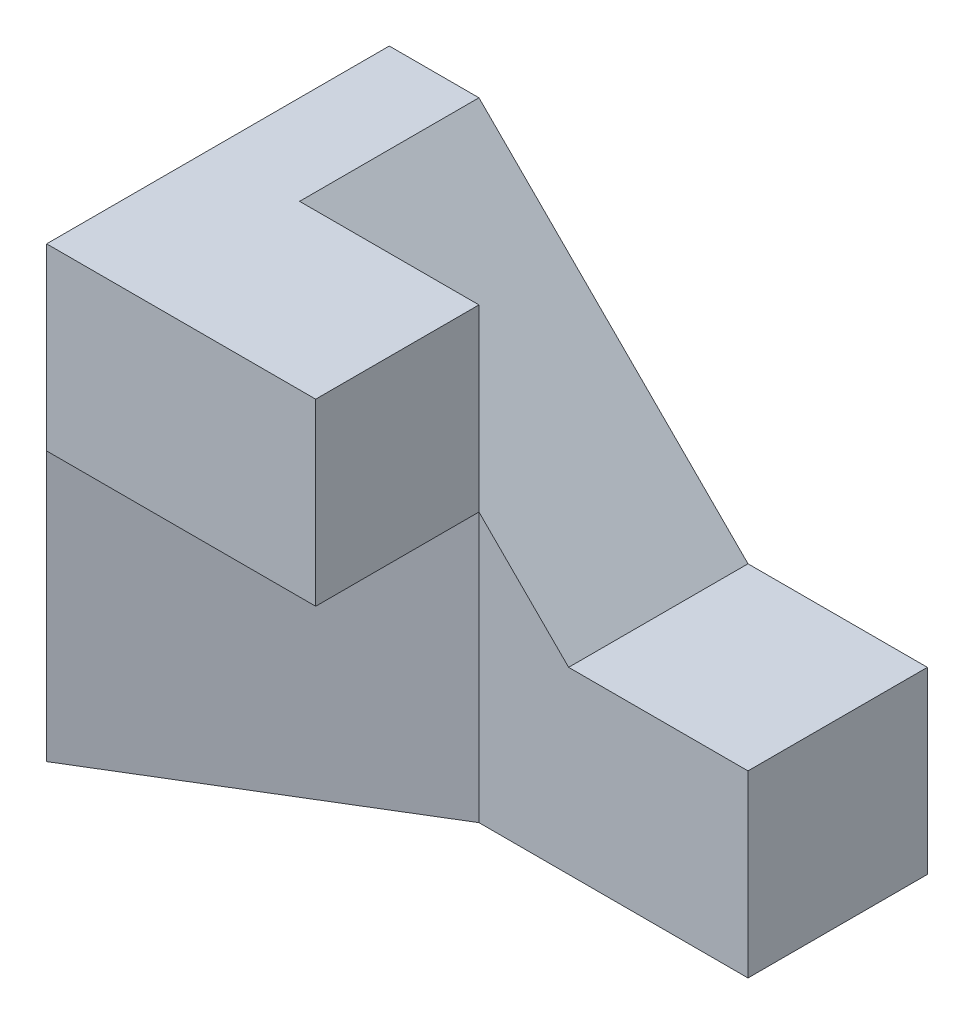
ISO-10303-21;
HEADER;
FILE_DESCRIPTION(('STEP AP214'),'2;1');
FILE_NAME('part.step','',(''),(''),'','','');
FILE_SCHEMA(('AUTOMOTIVE_DESIGN { 1 0 10303 214 1 1 1 1 }'));
ENDSEC;
DATA;
#1=APPLICATION_CONTEXT('core data for automotive mechanical design processes');
#2=APPLICATION_PROTOCOL_DEFINITION('international standard','automotive_design',2000,#1);
#3=PRODUCT_CONTEXT('',#1,'mechanical');
#4=PRODUCT('Part','Part','',(#3));
#5=PRODUCT_RELATED_PRODUCT_CATEGORY('part','',(#4));
#6=PRODUCT_DEFINITION_FORMATION('','',#4);
#7=PRODUCT_DEFINITION_CONTEXT('part definition',#1,'design');
#8=PRODUCT_DEFINITION('design','',#6,#7);
#9=PRODUCT_DEFINITION_SHAPE('','',#8);
#10=(LENGTH_UNIT() NAMED_UNIT(*) SI_UNIT(.MILLI.,.METRE.));
#11=(NAMED_UNIT(*) PLANE_ANGLE_UNIT() SI_UNIT($,.RADIAN.));
#12=(NAMED_UNIT(*) SI_UNIT($,.STERADIAN.) SOLID_ANGLE_UNIT());
#13=UNCERTAINTY_MEASURE_WITH_UNIT(LENGTH_MEASURE(1.E-05),#10,'distance_accuracy_value','');
#14=(GEOMETRIC_REPRESENTATION_CONTEXT(3) GLOBAL_UNCERTAINTY_ASSIGNED_CONTEXT((#13)) GLOBAL_UNIT_ASSIGNED_CONTEXT((#10,
#11,#12)) REPRESENTATION_CONTEXT('',''));
#15=CARTESIAN_POINT('',(0.,0.,0.));
#16=DIRECTION('',(0.,0.,1.));
#17=DIRECTION('',(1.,0.,0.));
#18=AXIS2_PLACEMENT_3D('',#15,#16,#17);
#19=CARTESIAN_POINT('',(0.,5.,-2.));
#20=DIRECTION('',(-1.,0.,0.));
#21=DIRECTION('',(0.,0.,1.));
#22=AXIS2_PLACEMENT_3D('',#19,#20,#21);
#23=PLANE('',#22);
#24=DIRECTION('',(0.,1.,0.));
#25=VECTOR('',#24,1.);
#26=CARTESIAN_POINT('',(0.,5.,1.82062342999278));
#27=LINE('',#26,#25);
#28=CARTESIAN_POINT('',(0.,3.,1.82062342999279));
#29=VERTEX_POINT('',#28);
#30=CARTESIAN_POINT('',(0.,5.,1.82062342999278));
#31=VERTEX_POINT('',#30);
#32=EDGE_CURVE('E227',#29,#31,#27,.T.);
#33=ORIENTED_EDGE('',*,*,#32,.T.);
#34=DIRECTION('',(0.,0.,1.));
#35=VECTOR('',#34,1.);
#36=CARTESIAN_POINT('',(0.,5.,-2.));
#37=LINE('',#36,#35);
#38=CARTESIAN_POINT('',(0.,5.,-2.));
#39=VERTEX_POINT('',#38);
#40=EDGE_CURVE('E11',#39,#31,#37,.T.);
#41=ORIENTED_EDGE('',*,*,#40,.F.);
#42=DIRECTION('',(0.,-1.,0.));
#43=VECTOR('',#42,1.);
#44=CARTESIAN_POINT('',(0.,5.,-2.));
#45=LINE('',#44,#43);
#46=CARTESIAN_POINT('',(0.,0.,-2.));
#47=VERTEX_POINT('',#46);
#48=EDGE_CURVE('E153',#39,#47,#45,.T.);
#49=ORIENTED_EDGE('',*,*,#48,.T.);
#50=DIRECTION('',(0.,0.,1.));
#51=VECTOR('',#50,1.);
#52=CARTESIAN_POINT('',(0.,0.,-2.));
#53=LINE('',#52,#51);
#54=CARTESIAN_POINT('',(0.,0.,1.82062342999278));
#55=VERTEX_POINT('',#54);
#56=EDGE_CURVE('E84',#47,#55,#53,.T.);
#57=ORIENTED_EDGE('',*,*,#56,.T.);
#58=DIRECTION('',(0.,1.,0.));
#59=VECTOR('',#58,1.);
#60=CARTESIAN_POINT('',(0.,0.,1.82062342999278));
#61=LINE('',#60,#59);
#62=EDGE_CURVE('E132',#55,#29,#61,.T.);
#63=ORIENTED_EDGE('',*,*,#62,.T.);
#64=EDGE_LOOP('',(#33,#41,#49,#57,#63));
#65=FACE_BOUND('',#64,.T.);
#66=ADVANCED_FACE('F33',(#65),#23,.T.);
#67=CARTESIAN_POINT('',(1.,5.,-2.));
#68=DIRECTION('',(0.,1.,0.));
#69=DIRECTION('',(0.,0.,1.));
#70=AXIS2_PLACEMENT_3D('',#67,#68,#69);
#71=PLANE('',#70);
#72=ORIENTED_EDGE('',*,*,#40,.T.);
#73=DIRECTION('',(-1.,0.,0.));
#74=VECTOR('',#73,1.);
#75=CARTESIAN_POINT('',(3.,5.,1.82062342999278));
#76=LINE('',#75,#74);
#77=CARTESIAN_POINT('',(3.,5.,1.82062342999278));
#78=VERTEX_POINT('',#77);
#79=EDGE_CURVE('E147',#78,#31,#76,.T.);
#80=ORIENTED_EDGE('',*,*,#79,.F.);
#81=DIRECTION('',(0.,0.,-1.));
#82=VECTOR('',#81,1.);
#83=CARTESIAN_POINT('',(3.,5.,0.));
#84=LINE('',#83,#82);
#85=CARTESIAN_POINT('',(3.,5.,0.));
#86=VERTEX_POINT('',#85);
#87=EDGE_CURVE('E221',#78,#86,#84,.T.);
#88=ORIENTED_EDGE('',*,*,#87,.T.);
#89=DIRECTION('',(-1.,0.,0.));
#90=VECTOR('',#89,1.);
#91=CARTESIAN_POINT('',(3.,5.,0.));
#92=LINE('',#91,#90);
#93=CARTESIAN_POINT('',(0.999999999999999,5.,0.));
#94=VERTEX_POINT('',#93);
#95=EDGE_CURVE('E141',#86,#94,#92,.T.);
#96=ORIENTED_EDGE('',*,*,#95,.T.);
#97=DIRECTION('',(0.,0.,1.));
#98=VECTOR('',#97,1.);
#99=CARTESIAN_POINT('',(1.,5.,-2.));
#100=LINE('',#99,#98);
#101=CARTESIAN_POINT('',(1.,5.,-2.));
#102=VERTEX_POINT('',#101);
#103=EDGE_CURVE('E41',#102,#94,#100,.T.);
#104=ORIENTED_EDGE('',*,*,#103,.F.);
#105=DIRECTION('',(-1.,0.,0.));
#106=VECTOR('',#105,1.);
#107=CARTESIAN_POINT('',(1.,5.,-2.));
#108=LINE('',#107,#106);
#109=EDGE_CURVE('E112',#102,#39,#108,.T.);
#110=ORIENTED_EDGE('',*,*,#109,.T.);
#111=EDGE_LOOP('',(#72,#80,#88,#96,#104,#110));
#112=FACE_BOUND('',#111,.T.);
#113=ADVANCED_FACE('F177',(#112),#71,.T.);
#114=CARTESIAN_POINT('',(4.,2.,-2.));
#115=DIRECTION('',(0.707106781186548,0.707106781186547,0.));
#116=DIRECTION('',(-0.707106781186547,0.707106781186548,0.));
#117=AXIS2_PLACEMENT_3D('',#114,#115,#116);
#118=PLANE('',#117);
#119=DIRECTION('',(-0.707106781186547,0.707106781186548,0.));
#120=VECTOR('',#119,1.);
#121=CARTESIAN_POINT('',(4.,2.,0.));
#122=LINE('',#121,#120);
#123=CARTESIAN_POINT('',(4.,2.,0.));
#124=VERTEX_POINT('',#123);
#125=CARTESIAN_POINT('',(3.,3.,0.));
#126=VERTEX_POINT('',#125);
#127=EDGE_CURVE('E101',#124,#126,#122,.T.);
#128=ORIENTED_EDGE('',*,*,#127,.F.);
#129=DIRECTION('',(0.,0.,1.));
#130=VECTOR('',#129,1.);
#131=CARTESIAN_POINT('',(4.,2.,-2.));
#132=LINE('',#131,#130);
#133=CARTESIAN_POINT('',(4.,2.,-2.));
#134=VERTEX_POINT('',#133);
#135=EDGE_CURVE('E75',#134,#124,#132,.T.);
#136=ORIENTED_EDGE('',*,*,#135,.F.);
#137=DIRECTION('',(-0.707106781186547,0.707106781186548,0.));
#138=VECTOR('',#137,1.);
#139=CARTESIAN_POINT('',(4.,2.,-2.));
#140=LINE('',#139,#138);
#141=EDGE_CURVE('E98',#134,#102,#140,.T.);
#142=ORIENTED_EDGE('',*,*,#141,.T.);
#143=ORIENTED_EDGE('',*,*,#103,.T.);
#144=EDGE_CURVE('E162',#126,#94,#122,.T.);
#145=ORIENTED_EDGE('',*,*,#144,.F.);
#146=EDGE_LOOP('',(#128,#136,#142,#143,#145));
#147=FACE_BOUND('',#146,.T.);
#148=ADVANCED_FACE('F96',(#147),#118,.T.);
#149=CARTESIAN_POINT('',(6.,2.,-2.));
#150=DIRECTION('',(0.,1.,0.));
#151=DIRECTION('',(-1.,0.,0.));
#152=AXIS2_PLACEMENT_3D('',#149,#150,#151);
#153=PLANE('',#152);
#154=DIRECTION('',(-1.,0.,0.));
#155=VECTOR('',#154,1.);
#156=CARTESIAN_POINT('',(6.,2.,0.));
#157=LINE('',#156,#155);
#158=CARTESIAN_POINT('',(6.,2.,0.));
#159=VERTEX_POINT('',#158);
#160=EDGE_CURVE('E163',#159,#124,#157,.T.);
#161=ORIENTED_EDGE('',*,*,#160,.F.);
#162=DIRECTION('',(0.,0.,1.));
#163=VECTOR('',#162,1.);
#164=CARTESIAN_POINT('',(6.,2.,-2.));
#165=LINE('',#164,#163);
#166=CARTESIAN_POINT('',(6.,2.,-2.));
#167=VERTEX_POINT('',#166);
#168=EDGE_CURVE('E103',#167,#159,#165,.T.);
#169=ORIENTED_EDGE('',*,*,#168,.F.);
#170=DIRECTION('',(-1.,0.,0.));
#171=VECTOR('',#170,1.);
#172=CARTESIAN_POINT('',(6.,2.,-2.));
#173=LINE('',#172,#171);
#174=EDGE_CURVE('E109',#167,#134,#173,.T.);
#175=ORIENTED_EDGE('',*,*,#174,.T.);
#176=ORIENTED_EDGE('',*,*,#135,.T.);
#177=EDGE_LOOP('',(#161,#169,#175,#176));
#178=FACE_BOUND('',#177,.T.);
#179=ADVANCED_FACE('F114',(#178),#153,.T.);
#180=CARTESIAN_POINT('',(6.,0.,-2.));
#181=DIRECTION('',(1.,0.,0.));
#182=DIRECTION('',(0.,0.,-1.));
#183=AXIS2_PLACEMENT_3D('',#180,#181,#182);
#184=PLANE('',#183);
#185=DIRECTION('',(0.,1.,0.));
#186=VECTOR('',#185,1.);
#187=CARTESIAN_POINT('',(6.,0.,0.));
#188=LINE('',#187,#186);
#189=CARTESIAN_POINT('',(6.,0.,0.));
#190=VERTEX_POINT('',#189);
#191=EDGE_CURVE('E124',#190,#159,#188,.T.);
#192=ORIENTED_EDGE('',*,*,#191,.F.);
#193=DIRECTION('',(0.,0.,1.));
#194=VECTOR('',#193,1.);
#195=CARTESIAN_POINT('',(6.,0.,-2.));
#196=LINE('',#195,#194);
#197=CARTESIAN_POINT('',(6.,0.,-2.));
#198=VERTEX_POINT('',#197);
#199=EDGE_CURVE('E156',#198,#190,#196,.T.);
#200=ORIENTED_EDGE('',*,*,#199,.F.);
#201=DIRECTION('',(0.,1.,0.));
#202=VECTOR('',#201,1.);
#203=CARTESIAN_POINT('',(6.,0.,-2.));
#204=LINE('',#203,#202);
#205=EDGE_CURVE('E115',#198,#167,#204,.T.);
#206=ORIENTED_EDGE('',*,*,#205,.T.);
#207=ORIENTED_EDGE('',*,*,#168,.T.);
#208=EDGE_LOOP('',(#192,#200,#206,#207));
#209=FACE_BOUND('',#208,.T.);
#210=ADVANCED_FACE('F168',(#209),#184,.T.);
#211=CARTESIAN_POINT('',(0.,0.,-2.));
#212=DIRECTION('',(0.,-1.,0.));
#213=DIRECTION('',(0.,0.,-1.));
#214=AXIS2_PLACEMENT_3D('',#211,#212,#213);
#215=PLANE('',#214);
#216=DIRECTION('',(1.,0.,0.));
#217=VECTOR('',#216,1.);
#218=CARTESIAN_POINT('',(0.,0.,0.));
#219=LINE('',#218,#217);
#220=CARTESIAN_POINT('',(3.,0.,0.));
#221=VERTEX_POINT('',#220);
#222=EDGE_CURVE('E127',#221,#190,#219,.T.);
#223=ORIENTED_EDGE('',*,*,#222,.F.);
#224=DIRECTION('',(-0.854889280090452,0.,0.51881048446078));
#225=VECTOR('',#224,1.);
#226=CARTESIAN_POINT('',(3.,0.,0.));
#227=LINE('',#226,#225);
#228=EDGE_CURVE('E134',#221,#55,#227,.T.);
#229=ORIENTED_EDGE('',*,*,#228,.T.);
#230=ORIENTED_EDGE('',*,*,#56,.F.);
#231=DIRECTION('',(1.,0.,0.));
#232=VECTOR('',#231,1.);
#233=CARTESIAN_POINT('',(0.,0.,-2.));
#234=LINE('',#233,#232);
#235=EDGE_CURVE('E117',#47,#198,#234,.T.);
#236=ORIENTED_EDGE('',*,*,#235,.T.);
#237=ORIENTED_EDGE('',*,*,#199,.T.);
#238=EDGE_LOOP('',(#223,#229,#230,#236,#237));
#239=FACE_BOUND('',#238,.T.);
#240=ADVANCED_FACE('F155',(#239),#215,.T.);
#241=CARTESIAN_POINT('',(0.,0.,-2.));
#242=DIRECTION('',(0.,0.,1.));
#243=DIRECTION('',(1.,0.,0.));
#244=AXIS2_PLACEMENT_3D('',#241,#242,#243);
#245=PLANE('',#244);
#246=ORIENTED_EDGE('',*,*,#48,.F.);
#247=ORIENTED_EDGE('',*,*,#109,.F.);
#248=ORIENTED_EDGE('',*,*,#141,.F.);
#249=ORIENTED_EDGE('',*,*,#174,.F.);
#250=ORIENTED_EDGE('',*,*,#205,.F.);
#251=ORIENTED_EDGE('',*,*,#235,.F.);
#252=EDGE_LOOP('',(#246,#247,#248,#249,#250,#251));
#253=FACE_BOUND('',#252,.T.);
#254=ADVANCED_FACE('F107',(#253),#245,.F.);
#255=CARTESIAN_POINT('',(0.,0.,0.));
#256=DIRECTION('',(0.,0.,1.));
#257=DIRECTION('',(1.,0.,0.));
#258=AXIS2_PLACEMENT_3D('',#255,#256,#257);
#259=PLANE('',#258);
#260=DIRECTION('',(0.,1.,0.));
#261=VECTOR('',#260,1.);
#262=CARTESIAN_POINT('',(3.,0.,0.));
#263=LINE('',#262,#261);
#264=EDGE_CURVE('E49',#221,#126,#263,.T.);
#265=ORIENTED_EDGE('',*,*,#264,.F.);
#266=ORIENTED_EDGE('',*,*,#222,.T.);
#267=ORIENTED_EDGE('',*,*,#191,.T.);
#268=ORIENTED_EDGE('',*,*,#160,.T.);
#269=ORIENTED_EDGE('',*,*,#127,.T.);
#270=EDGE_LOOP('',(#265,#266,#267,#268,#269));
#271=FACE_BOUND('',#270,.T.);
#272=ADVANCED_FACE('F166',(#271),#259,.T.);
#273=CARTESIAN_POINT('',(3.,0.,0.));
#274=DIRECTION('',(-0.51881048446078,0.,-0.854889280090452));
#275=DIRECTION('',(-0.854889280090452,0.,0.51881048446078));
#276=AXIS2_PLACEMENT_3D('',#273,#274,#275);
#277=PLANE('',#276);
#278=DIRECTION('',(-0.854889280090452,0.,0.51881048446078));
#279=VECTOR('',#278,1.);
#280=CARTESIAN_POINT('',(3.,3.,0.));
#281=LINE('',#280,#279);
#282=EDGE_CURVE('E135',#126,#29,#281,.T.);
#283=ORIENTED_EDGE('',*,*,#282,.T.);
#284=ORIENTED_EDGE('',*,*,#62,.F.);
#285=ORIENTED_EDGE('',*,*,#228,.F.);
#286=ORIENTED_EDGE('',*,*,#264,.T.);
#287=EDGE_LOOP('',(#283,#284,#285,#286));
#288=FACE_BOUND('',#287,.T.);
#289=ADVANCED_FACE('F190',(#288),#277,.F.);
#290=CARTESIAN_POINT('',(3.,3.,0.));
#291=DIRECTION('',(0.,-1.,0.));
#292=DIRECTION('',(0.,0.,-1.));
#293=AXIS2_PLACEMENT_3D('',#290,#291,#292);
#294=PLANE('',#293);
#295=ORIENTED_EDGE('',*,*,#282,.F.);
#296=DIRECTION('',(0.,0.,1.));
#297=VECTOR('',#296,1.);
#298=CARTESIAN_POINT('',(3.,3.,0.));
#299=LINE('',#298,#297);
#300=CARTESIAN_POINT('',(3.,3.,1.82062342999279));
#301=VERTEX_POINT('',#300);
#302=EDGE_CURVE('E224',#126,#301,#299,.T.);
#303=ORIENTED_EDGE('',*,*,#302,.T.);
#304=DIRECTION('',(-1.,0.,0.));
#305=VECTOR('',#304,1.);
#306=CARTESIAN_POINT('',(3.,3.,1.82062342999279));
#307=LINE('',#306,#305);
#308=EDGE_CURVE('E150',#301,#29,#307,.T.);
#309=ORIENTED_EDGE('',*,*,#308,.T.);
#310=EDGE_LOOP('',(#295,#303,#309));
#311=FACE_BOUND('',#310,.T.);
#312=ADVANCED_FACE('F195',(#311),#294,.T.);
#313=CARTESIAN_POINT('',(3.,5.,0.));
#314=DIRECTION('',(0.,0.,-1.));
#315=DIRECTION('',(0.,1.,0.));
#316=AXIS2_PLACEMENT_3D('',#313,#314,#315);
#317=PLANE('',#316);
#318=DIRECTION('',(0.,-1.,0.));
#319=VECTOR('',#318,1.);
#320=CARTESIAN_POINT('',(3.,5.,0.));
#321=LINE('',#320,#319);
#322=EDGE_CURVE('E217',#86,#126,#321,.T.);
#323=ORIENTED_EDGE('',*,*,#322,.T.);
#324=ORIENTED_EDGE('',*,*,#144,.T.);
#325=ORIENTED_EDGE('',*,*,#95,.F.);
#326=EDGE_LOOP('',(#323,#324,#325));
#327=FACE_BOUND('',#326,.T.);
#328=ADVANCED_FACE('F196',(#327),#317,.T.);
#329=CARTESIAN_POINT('',(3.,5.,1.82062342999278));
#330=DIRECTION('',(0.,0.,1.));
#331=DIRECTION('',(0.,-1.,0.));
#332=AXIS2_PLACEMENT_3D('',#329,#330,#331);
#333=PLANE('',#332);
#334=ORIENTED_EDGE('',*,*,#32,.F.);
#335=ORIENTED_EDGE('',*,*,#308,.F.);
#336=DIRECTION('',(0.,1.,0.));
#337=VECTOR('',#336,1.);
#338=CARTESIAN_POINT('',(3.,5.,1.82062342999278));
#339=LINE('',#338,#337);
#340=EDGE_CURVE('E232',#301,#78,#339,.T.);
#341=ORIENTED_EDGE('',*,*,#340,.T.);
#342=ORIENTED_EDGE('',*,*,#79,.T.);
#343=EDGE_LOOP('',(#334,#335,#341,#342));
#344=FACE_BOUND('',#343,.T.);
#345=ADVANCED_FACE('F199',(#344),#333,.T.);
#346=CARTESIAN_POINT('',(3.,0.,0.));
#347=DIRECTION('',(-1.,0.,0.));
#348=DIRECTION('',(0.,0.,1.));
#349=AXIS2_PLACEMENT_3D('',#346,#347,#348);
#350=PLANE('',#349);
#351=ORIENTED_EDGE('',*,*,#322,.F.);
#352=ORIENTED_EDGE('',*,*,#87,.F.);
#353=ORIENTED_EDGE('',*,*,#340,.F.);
#354=ORIENTED_EDGE('',*,*,#302,.F.);
#355=EDGE_LOOP('',(#351,#352,#353,#354));
#356=FACE_BOUND('',#355,.T.);
#357=ADVANCED_FACE('F206',(#356),#350,.F.);
#358=CLOSED_SHELL('',(#66,#113,#148,#179,#210,#240,#254,#272,#289,#312,#328,#345,#357));
#359=MANIFOLD_SOLID_BREP('B2',#358);
#360=ADVANCED_BREP_SHAPE_REPRESENTATION('',(#18,#359),#14);
#361=SHAPE_DEFINITION_REPRESENTATION(#9,#360);
ENDSEC;
END-ISO-10303-21;
